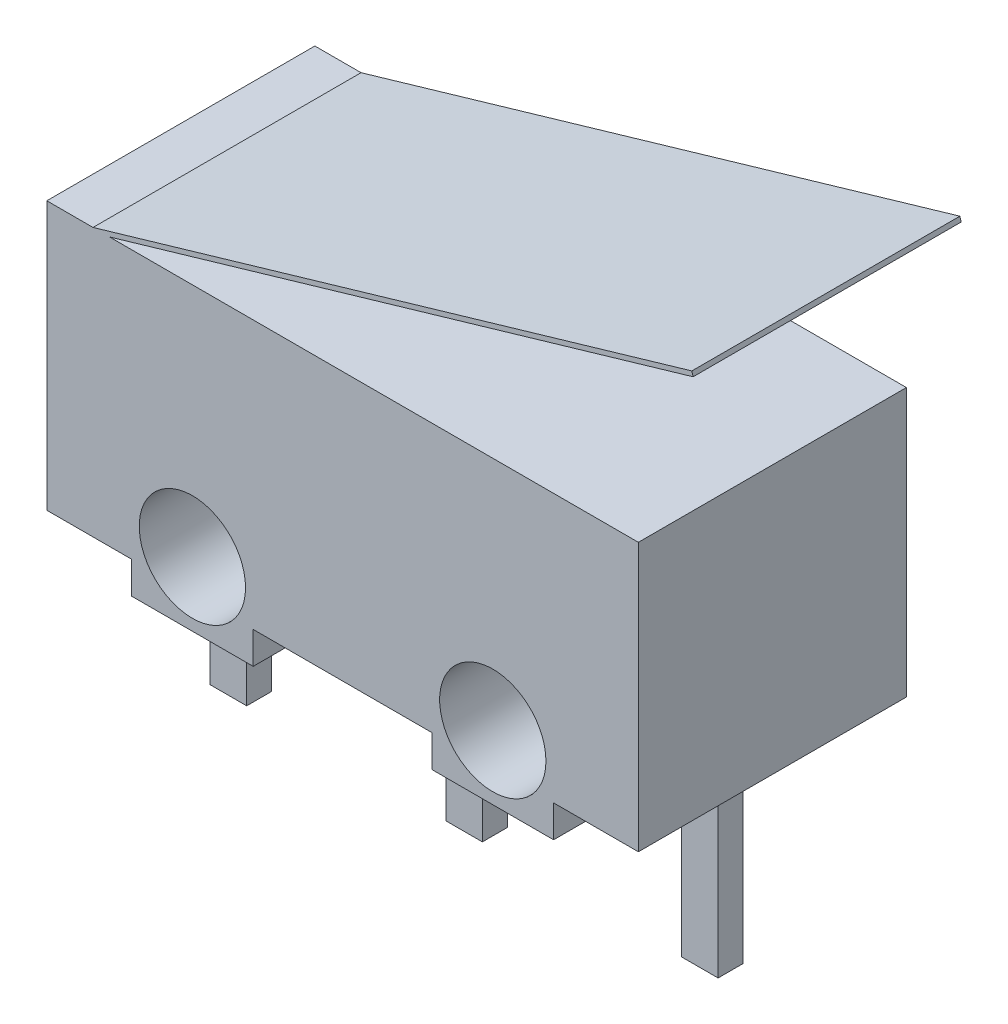
ISO-10303-21;
HEADER;
FILE_DESCRIPTION(('STEP AP214'),'2;1');
FILE_NAME('part.step','',(''),(''),'','','');
FILE_SCHEMA(('AUTOMOTIVE_DESIGN { 1 0 10303 214 1 1 1 1 }'));
ENDSEC;
DATA;
#1=APPLICATION_CONTEXT('core data for automotive mechanical design processes');
#2=APPLICATION_PROTOCOL_DEFINITION('international standard','automotive_design',2000,#1);
#3=PRODUCT_CONTEXT('',#1,'mechanical');
#4=PRODUCT('Part','Part','',(#3));
#5=PRODUCT_RELATED_PRODUCT_CATEGORY('part','',(#4));
#6=PRODUCT_DEFINITION_FORMATION('','',#4);
#7=PRODUCT_DEFINITION_CONTEXT('part definition',#1,'design');
#8=PRODUCT_DEFINITION('design','',#6,#7);
#9=PRODUCT_DEFINITION_SHAPE('','',#8);
#10=(LENGTH_UNIT() NAMED_UNIT(*) SI_UNIT(.MILLI.,.METRE.));
#11=(NAMED_UNIT(*) PLANE_ANGLE_UNIT() SI_UNIT($,.RADIAN.));
#12=(NAMED_UNIT(*) SI_UNIT($,.STERADIAN.) SOLID_ANGLE_UNIT());
#13=UNCERTAINTY_MEASURE_WITH_UNIT(LENGTH_MEASURE(1.E-05),#10,'distance_accuracy_value','');
#14=(GEOMETRIC_REPRESENTATION_CONTEXT(3) GLOBAL_UNCERTAINTY_ASSIGNED_CONTEXT((#13)) GLOBAL_UNIT_ASSIGNED_CONTEXT((#10,
#11,#12)) REPRESENTATION_CONTEXT('',''));
#15=CARTESIAN_POINT('',(0.,0.,0.));
#16=DIRECTION('',(0.,0.,1.));
#17=DIRECTION('',(1.,0.,0.));
#18=AXIS2_PLACEMENT_3D('',#15,#16,#17);
#19=CARTESIAN_POINT('',(6.4,2.9,-2.9));
#20=DIRECTION('',(0.,1.,0.));
#21=DIRECTION('',(-1.,0.,0.));
#22=AXIS2_PLACEMENT_3D('',#19,#20,#21);
#23=PLANE('',#22);
#24=DIRECTION('',(0.,0.,-1.));
#25=VECTOR('',#24,1.);
#26=CARTESIAN_POINT('',(-5.04379947229552,2.9,-2.9));
#27=LINE('',#26,#25);
#28=CARTESIAN_POINT('',(-5.0437994722955,2.9,2.9));
#29=VERTEX_POINT('',#28);
#30=CARTESIAN_POINT('',(-5.0437994722955,2.9,-2.9));
#31=VERTEX_POINT('',#30);
#32=EDGE_CURVE('E413',#29,#31,#27,.T.);
#33=ORIENTED_EDGE('',*,*,#32,.F.);
#34=DIRECTION('',(-1.,0.,0.));
#35=VECTOR('',#34,1.);
#36=CARTESIAN_POINT('',(6.4,2.9,2.9));
#37=LINE('',#36,#35);
#38=CARTESIAN_POINT('',(6.4,2.9,2.9));
#39=VERTEX_POINT('',#38);
#40=EDGE_CURVE('E463',#39,#29,#37,.T.);
#41=ORIENTED_EDGE('',*,*,#40,.F.);
#42=DIRECTION('',(0.,0.,1.));
#43=VECTOR('',#42,1.);
#44=CARTESIAN_POINT('',(6.4,2.9,-2.9));
#45=LINE('',#44,#43);
#46=CARTESIAN_POINT('',(6.4,2.9,-2.9));
#47=VERTEX_POINT('',#46);
#48=EDGE_CURVE('E49',#47,#39,#45,.T.);
#49=ORIENTED_EDGE('',*,*,#48,.F.);
#50=DIRECTION('',(-1.,0.,0.));
#51=VECTOR('',#50,1.);
#52=CARTESIAN_POINT('',(6.4,2.9,-2.9));
#53=LINE('',#52,#51);
#54=EDGE_CURVE('E504',#47,#31,#53,.T.);
#55=ORIENTED_EDGE('',*,*,#54,.T.);
#56=EDGE_LOOP('',(#33,#41,#49,#55));
#57=FACE_BOUND('',#56,.T.);
#58=DIRECTION('',(-1.,0.,0.));
#59=VECTOR('',#58,1.);
#60=CARTESIAN_POINT('',(-2.6,2.9,-1.425));
#61=LINE('',#60,#59);
#62=CARTESIAN_POINT('',(-1.71,2.9,-1.425));
#63=VERTEX_POINT('',#62);
#64=CARTESIAN_POINT('',(-2.6,2.9,-1.425));
#65=VERTEX_POINT('',#64);
#66=EDGE_CURVE('E897',#63,#65,#61,.T.);
#67=ORIENTED_EDGE('',*,*,#66,.F.);
#68=DIRECTION('',(0.,0.,-1.));
#69=VECTOR('',#68,1.);
#70=CARTESIAN_POINT('',(-1.71,2.9,-1.425));
#71=LINE('',#70,#69);
#72=CARTESIAN_POINT('',(-1.71,2.9,1.425));
#73=VERTEX_POINT('',#72);
#74=EDGE_CURVE('E276',#73,#63,#71,.T.);
#75=ORIENTED_EDGE('',*,*,#74,.F.);
#76=DIRECTION('',(1.,0.,0.));
#77=VECTOR('',#76,1.);
#78=CARTESIAN_POINT('',(-2.6,2.9,1.425));
#79=LINE('',#78,#77);
#80=CARTESIAN_POINT('',(-2.6,2.9,1.425));
#81=VERTEX_POINT('',#80);
#82=EDGE_CURVE('E272',#81,#73,#79,.T.);
#83=ORIENTED_EDGE('',*,*,#82,.F.);
#84=DIRECTION('',(0.,0.,1.));
#85=VECTOR('',#84,1.);
#86=CARTESIAN_POINT('',(-2.6,2.9,-1.425));
#87=LINE('',#86,#85);
#88=EDGE_CURVE('E893',#65,#81,#87,.T.);
#89=ORIENTED_EDGE('',*,*,#88,.F.);
#90=EDGE_LOOP('',(#67,#75,#83,#89));
#91=FACE_BOUND('',#90,.T.);
#92=ADVANCED_FACE('F39',(#57,#91),#23,.T.);
#93=CARTESIAN_POINT('',(-5.4,2.9,2.9));
#94=VERTEX_POINT('',#93);
#95=CARTESIAN_POINT('',(-6.4,2.9,2.9));
#96=VERTEX_POINT('',#95);
#97=EDGE_CURVE('E550',#94,#96,#37,.T.);
#98=ORIENTED_EDGE('',*,*,#97,.F.);
#99=DIRECTION('',(0.,0.,1.));
#100=VECTOR('',#99,1.);
#101=CARTESIAN_POINT('',(-5.4,2.9,-16.4541518362062));
#102=LINE('',#101,#100);
#103=CARTESIAN_POINT('',(-5.4,2.9,-2.9));
#104=VERTEX_POINT('',#103);
#105=EDGE_CURVE('E425',#104,#94,#102,.T.);
#106=ORIENTED_EDGE('',*,*,#105,.F.);
#107=CARTESIAN_POINT('',(-6.4,2.9,-2.9));
#108=VERTEX_POINT('',#107);
#109=EDGE_CURVE('E503',#104,#108,#53,.T.);
#110=ORIENTED_EDGE('',*,*,#109,.T.);
#111=DIRECTION('',(0.,0.,1.));
#112=VECTOR('',#111,1.);
#113=CARTESIAN_POINT('',(-6.4,2.9,-2.9));
#114=LINE('',#113,#112);
#115=EDGE_CURVE('E11',#108,#96,#114,.T.);
#116=ORIENTED_EDGE('',*,*,#115,.T.);
#117=EDGE_LOOP('',(#98,#106,#110,#116));
#118=FACE_BOUND('',#117,.T.);
#119=ADVANCED_FACE('F599',(#118),#23,.T.);
#120=CARTESIAN_POINT('',(-6.4,-2.9,-2.9));
#121=DIRECTION('',(-1.,0.,0.));
#122=DIRECTION('',(0.,0.,1.));
#123=AXIS2_PLACEMENT_3D('',#120,#121,#122);
#124=PLANE('',#123);
#125=DIRECTION('',(0.,-1.,0.));
#126=VECTOR('',#125,1.);
#127=CARTESIAN_POINT('',(-6.4,-2.9,2.9));
#128=LINE('',#127,#126);
#129=CARTESIAN_POINT('',(-6.4,-2.9,2.9));
#130=VERTEX_POINT('',#129);
#131=EDGE_CURVE('E454',#96,#130,#128,.T.);
#132=ORIENTED_EDGE('',*,*,#131,.F.);
#133=ORIENTED_EDGE('',*,*,#115,.F.);
#134=DIRECTION('',(0.,-1.,0.));
#135=VECTOR('',#134,1.);
#136=CARTESIAN_POINT('',(-6.4,-2.9,-2.9));
#137=LINE('',#136,#135);
#138=CARTESIAN_POINT('',(-6.4,-2.9,-2.9));
#139=VERTEX_POINT('',#138);
#140=EDGE_CURVE('E458',#108,#139,#137,.T.);
#141=ORIENTED_EDGE('',*,*,#140,.T.);
#142=DIRECTION('',(0.,0.,1.));
#143=VECTOR('',#142,1.);
#144=CARTESIAN_POINT('',(-6.4,-2.9,-2.9));
#145=LINE('',#144,#143);
#146=EDGE_CURVE('E43',#139,#130,#145,.T.);
#147=ORIENTED_EDGE('',*,*,#146,.T.);
#148=EDGE_LOOP('',(#132,#133,#141,#147));
#149=FACE_BOUND('',#148,.T.);
#150=ADVANCED_FACE('F41',(#149),#124,.T.);
#151=CARTESIAN_POINT('',(6.4,-2.9,-2.9));
#152=DIRECTION('',(1.,0.,0.));
#153=DIRECTION('',(0.,0.,-1.));
#154=AXIS2_PLACEMENT_3D('',#151,#152,#153);
#155=PLANE('',#154);
#156=DIRECTION('',(0.,1.,0.));
#157=VECTOR('',#156,1.);
#158=CARTESIAN_POINT('',(6.4,-2.9,2.9));
#159=LINE('',#158,#157);
#160=CARTESIAN_POINT('',(6.4,-2.9,2.9));
#161=VERTEX_POINT('',#160);
#162=EDGE_CURVE('E546',#161,#39,#159,.T.);
#163=ORIENTED_EDGE('',*,*,#162,.F.);
#164=DIRECTION('',(0.,0.,1.));
#165=VECTOR('',#164,1.);
#166=CARTESIAN_POINT('',(6.4,-2.9,-2.9));
#167=LINE('',#166,#165);
#168=CARTESIAN_POINT('',(6.4,-2.9,-2.9));
#169=VERTEX_POINT('',#168);
#170=EDGE_CURVE('E556',#169,#161,#167,.T.);
#171=ORIENTED_EDGE('',*,*,#170,.F.);
#172=DIRECTION('',(0.,1.,0.));
#173=VECTOR('',#172,1.);
#174=CARTESIAN_POINT('',(6.4,-2.9,-2.9));
#175=LINE('',#174,#173);
#176=EDGE_CURVE('E499',#169,#47,#175,.T.);
#177=ORIENTED_EDGE('',*,*,#176,.T.);
#178=ORIENTED_EDGE('',*,*,#48,.T.);
#179=EDGE_LOOP('',(#163,#171,#177,#178));
#180=FACE_BOUND('',#179,.T.);
#181=ADVANCED_FACE('F638',(#180),#155,.T.);
#182=CARTESIAN_POINT('',(4.56583824460717,-2.9,-2.9));
#183=DIRECTION('',(0.,-1.,0.));
#184=DIRECTION('',(1.,0.,0.));
#185=AXIS2_PLACEMENT_3D('',#182,#183,#184);
#186=PLANE('',#185);
#187=DIRECTION('',(1.,0.,0.));
#188=VECTOR('',#187,1.);
#189=CARTESIAN_POINT('',(5.49500000000001,-2.9,0.27));
#190=LINE('',#189,#188);
#191=CARTESIAN_POINT('',(4.705,-2.9,0.27));
#192=VERTEX_POINT('',#191);
#193=CARTESIAN_POINT('',(5.495,-2.9,0.27));
#194=VERTEX_POINT('',#193);
#195=EDGE_CURVE('E319',#192,#194,#190,.T.);
#196=ORIENTED_EDGE('',*,*,#195,.T.);
#197=DIRECTION('',(0.,0.,-1.));
#198=VECTOR('',#197,1.);
#199=CARTESIAN_POINT('',(5.495,-2.9,-0.27));
#200=LINE('',#199,#198);
#201=CARTESIAN_POINT('',(5.495,-2.9,-0.27));
#202=VERTEX_POINT('',#201);
#203=EDGE_CURVE('E316',#194,#202,#200,.T.);
#204=ORIENTED_EDGE('',*,*,#203,.T.);
#205=DIRECTION('',(-1.,0.,0.));
#206=VECTOR('',#205,1.);
#207=CARTESIAN_POINT('',(5.49500000000001,-2.9,-0.27));
#208=LINE('',#207,#206);
#209=CARTESIAN_POINT('',(4.705,-2.9,-0.27));
#210=VERTEX_POINT('',#209);
#211=EDGE_CURVE('E279',#202,#210,#208,.T.);
#212=ORIENTED_EDGE('',*,*,#211,.T.);
#213=DIRECTION('',(0.,0.,1.));
#214=VECTOR('',#213,1.);
#215=CARTESIAN_POINT('',(4.705,-2.9,-0.27));
#216=LINE('',#215,#214);
#217=EDGE_CURVE('E65',#210,#192,#216,.T.);
#218=ORIENTED_EDGE('',*,*,#217,.T.);
#219=EDGE_LOOP('',(#196,#204,#212,#218));
#220=FACE_BOUND('',#219,.T.);
#221=DIRECTION('',(1.,0.,0.));
#222=VECTOR('',#221,1.);
#223=CARTESIAN_POINT('',(4.56583824460717,-2.9,2.9));
#224=LINE('',#223,#222);
#225=CARTESIAN_POINT('',(4.56583824460717,-2.9,2.9));
#226=VERTEX_POINT('',#225);
#227=EDGE_CURVE('E542',#226,#161,#224,.T.);
#228=ORIENTED_EDGE('',*,*,#227,.F.);
#229=DIRECTION('',(0.,0.,1.));
#230=VECTOR('',#229,1.);
#231=CARTESIAN_POINT('',(4.56583824460717,-2.9,-2.9));
#232=LINE('',#231,#230);
#233=CARTESIAN_POINT('',(4.56583824460717,-2.9,-2.9));
#234=VERTEX_POINT('',#233);
#235=EDGE_CURVE('E559',#234,#226,#232,.T.);
#236=ORIENTED_EDGE('',*,*,#235,.F.);
#237=DIRECTION('',(1.,0.,0.));
#238=VECTOR('',#237,1.);
#239=CARTESIAN_POINT('',(4.56583824460717,-2.9,-2.9));
#240=LINE('',#239,#238);
#241=EDGE_CURVE('E495',#234,#169,#240,.T.);
#242=ORIENTED_EDGE('',*,*,#241,.T.);
#243=ORIENTED_EDGE('',*,*,#170,.T.);
#244=EDGE_LOOP('',(#228,#236,#242,#243));
#245=FACE_BOUND('',#244,.T.);
#246=ADVANCED_FACE('F634',(#220,#245),#186,.T.);
#247=CARTESIAN_POINT('',(4.56583824460717,-3.5923412014627,-2.9));
#248=DIRECTION('',(1.,0.,0.));
#249=DIRECTION('',(0.,0.,-1.));
#250=AXIS2_PLACEMENT_3D('',#247,#248,#249);
#251=PLANE('',#250);
#252=DIRECTION('',(0.,1.,0.));
#253=VECTOR('',#252,1.);
#254=CARTESIAN_POINT('',(4.56583824460717,-3.5923412014627,2.9));
#255=LINE('',#254,#253);
#256=CARTESIAN_POINT('',(4.56583824460717,-3.5923412014627,2.9));
#257=VERTEX_POINT('',#256);
#258=EDGE_CURVE('E538',#257,#226,#255,.T.);
#259=ORIENTED_EDGE('',*,*,#258,.F.);
#260=DIRECTION('',(0.,0.,1.));
#261=VECTOR('',#260,1.);
#262=CARTESIAN_POINT('',(4.56583824460717,-3.5923412014627,-2.9));
#263=LINE('',#262,#261);
#264=CARTESIAN_POINT('',(4.56583824460717,-3.5923412014627,-2.9));
#265=VERTEX_POINT('',#264);
#266=EDGE_CURVE('E562',#265,#257,#263,.T.);
#267=ORIENTED_EDGE('',*,*,#266,.F.);
#268=DIRECTION('',(0.,1.,0.));
#269=VECTOR('',#268,1.);
#270=CARTESIAN_POINT('',(4.56583824460717,-3.5923412014627,-2.9));
#271=LINE('',#270,#269);
#272=EDGE_CURVE('E491',#265,#234,#271,.T.);
#273=ORIENTED_EDGE('',*,*,#272,.T.);
#274=ORIENTED_EDGE('',*,*,#235,.T.);
#275=EDGE_LOOP('',(#259,#267,#273,#274));
#276=FACE_BOUND('',#275,.T.);
#277=ADVANCED_FACE('F629',(#276),#251,.T.);
#278=CARTESIAN_POINT('',(1.93416175539283,-3.5923412014627,-2.9));
#279=DIRECTION('',(0.,-1.,0.));
#280=DIRECTION('',(0.,0.,-1.));
#281=AXIS2_PLACEMENT_3D('',#278,#279,#280);
#282=PLANE('',#281);
#283=DIRECTION('',(1.,0.,0.));
#284=VECTOR('',#283,1.);
#285=CARTESIAN_POINT('',(1.93416175539283,-3.5923412014627,2.9));
#286=LINE('',#285,#284);
#287=CARTESIAN_POINT('',(1.93416175539283,-3.5923412014627,2.9));
#288=VERTEX_POINT('',#287);
#289=EDGE_CURVE('E534',#288,#257,#286,.T.);
#290=ORIENTED_EDGE('',*,*,#289,.F.);
#291=DIRECTION('',(0.,0.,1.));
#292=VECTOR('',#291,1.);
#293=CARTESIAN_POINT('',(1.93416175539283,-3.5923412014627,-2.9));
#294=LINE('',#293,#292);
#295=CARTESIAN_POINT('',(1.93416175539283,-3.5923412014627,-2.9));
#296=VERTEX_POINT('',#295);
#297=EDGE_CURVE('E565',#296,#288,#294,.T.);
#298=ORIENTED_EDGE('',*,*,#297,.F.);
#299=DIRECTION('',(1.,0.,0.));
#300=VECTOR('',#299,1.);
#301=CARTESIAN_POINT('',(1.93416175539283,-3.5923412014627,-2.9));
#302=LINE('',#301,#300);
#303=EDGE_CURVE('E487',#296,#265,#302,.T.);
#304=ORIENTED_EDGE('',*,*,#303,.T.);
#305=ORIENTED_EDGE('',*,*,#266,.T.);
#306=EDGE_LOOP('',(#290,#298,#304,#305));
#307=FACE_BOUND('',#306,.T.);
#308=ADVANCED_FACE('F625',(#307),#282,.T.);
#309=CARTESIAN_POINT('',(1.93416175539283,-2.9,-2.9));
#310=DIRECTION('',(-1.,0.,0.));
#311=DIRECTION('',(0.,0.,1.));
#312=AXIS2_PLACEMENT_3D('',#309,#310,#311);
#313=PLANE('',#312);
#314=DIRECTION('',(0.,-1.,0.));
#315=VECTOR('',#314,1.);
#316=CARTESIAN_POINT('',(1.93416175539283,-2.9,2.9));
#317=LINE('',#316,#315);
#318=CARTESIAN_POINT('',(1.93416175539283,-2.9,2.9));
#319=VERTEX_POINT('',#318);
#320=EDGE_CURVE('E530',#319,#288,#317,.T.);
#321=ORIENTED_EDGE('',*,*,#320,.F.);
#322=DIRECTION('',(0.,0.,1.));
#323=VECTOR('',#322,1.);
#324=CARTESIAN_POINT('',(1.93416175539283,-2.9,-2.9));
#325=LINE('',#324,#323);
#326=CARTESIAN_POINT('',(1.93416175539283,-2.9,-2.9));
#327=VERTEX_POINT('',#326);
#328=EDGE_CURVE('E568',#327,#319,#325,.T.);
#329=ORIENTED_EDGE('',*,*,#328,.F.);
#330=DIRECTION('',(0.,-1.,0.));
#331=VECTOR('',#330,1.);
#332=CARTESIAN_POINT('',(1.93416175539283,-2.9,-2.9));
#333=LINE('',#332,#331);
#334=EDGE_CURVE('E483',#327,#296,#333,.T.);
#335=ORIENTED_EDGE('',*,*,#334,.T.);
#336=ORIENTED_EDGE('',*,*,#297,.T.);
#337=EDGE_LOOP('',(#321,#329,#335,#336));
#338=FACE_BOUND('',#337,.T.);
#339=ADVANCED_FACE('F621',(#338),#313,.T.);
#340=CARTESIAN_POINT('',(-1.93416175539283,-2.9,-2.9));
#341=DIRECTION('',(0.,-1.,0.));
#342=DIRECTION('',(0.,0.,-1.));
#343=AXIS2_PLACEMENT_3D('',#340,#341,#342);
#344=PLANE('',#343);
#345=DIRECTION('',(-1.,0.,0.));
#346=VECTOR('',#345,1.);
#347=CARTESIAN_POINT('',(0.395,-2.9,-0.27));
#348=LINE('',#347,#346);
#349=CARTESIAN_POINT('',(0.394999999999999,-2.9,-0.27));
#350=VERTEX_POINT('',#349);
#351=CARTESIAN_POINT('',(-0.395,-2.9,-0.27));
#352=VERTEX_POINT('',#351);
#353=EDGE_CURVE('E396',#350,#352,#348,.T.);
#354=ORIENTED_EDGE('',*,*,#353,.T.);
#355=DIRECTION('',(0.,0.,1.));
#356=VECTOR('',#355,1.);
#357=CARTESIAN_POINT('',(-0.395,-2.9,-0.27));
#358=LINE('',#357,#356);
#359=CARTESIAN_POINT('',(-0.395,-2.9,0.27));
#360=VERTEX_POINT('',#359);
#361=EDGE_CURVE('E393',#352,#360,#358,.T.);
#362=ORIENTED_EDGE('',*,*,#361,.T.);
#363=DIRECTION('',(1.,0.,0.));
#364=VECTOR('',#363,1.);
#365=CARTESIAN_POINT('',(0.395,-2.9,0.27));
#366=LINE('',#365,#364);
#367=CARTESIAN_POINT('',(0.395,-2.9,0.27));
#368=VERTEX_POINT('',#367);
#369=EDGE_CURVE('E355',#360,#368,#366,.T.);
#370=ORIENTED_EDGE('',*,*,#369,.T.);
#371=DIRECTION('',(0.,0.,-1.));
#372=VECTOR('',#371,1.);
#373=CARTESIAN_POINT('',(0.395,-2.9,-0.27));
#374=LINE('',#373,#372);
#375=EDGE_CURVE('E399',#368,#350,#374,.T.);
#376=ORIENTED_EDGE('',*,*,#375,.T.);
#377=EDGE_LOOP('',(#354,#362,#370,#376));
#378=FACE_BOUND('',#377,.T.);
#379=DIRECTION('',(1.,0.,0.));
#380=VECTOR('',#379,1.);
#381=CARTESIAN_POINT('',(-1.93416175539283,-2.9,2.9));
#382=LINE('',#381,#380);
#383=CARTESIAN_POINT('',(-1.93416175539283,-2.9,2.9));
#384=VERTEX_POINT('',#383);
#385=EDGE_CURVE('E526',#384,#319,#382,.T.);
#386=ORIENTED_EDGE('',*,*,#385,.F.);
#387=DIRECTION('',(0.,0.,1.));
#388=VECTOR('',#387,1.);
#389=CARTESIAN_POINT('',(-1.93416175539283,-2.9,-2.9));
#390=LINE('',#389,#388);
#391=CARTESIAN_POINT('',(-1.93416175539283,-2.9,-2.9));
#392=VERTEX_POINT('',#391);
#393=EDGE_CURVE('E571',#392,#384,#390,.T.);
#394=ORIENTED_EDGE('',*,*,#393,.F.);
#395=DIRECTION('',(1.,0.,0.));
#396=VECTOR('',#395,1.);
#397=CARTESIAN_POINT('',(-1.93416175539283,-2.9,-2.9));
#398=LINE('',#397,#396);
#399=EDGE_CURVE('E479',#392,#327,#398,.T.);
#400=ORIENTED_EDGE('',*,*,#399,.T.);
#401=ORIENTED_EDGE('',*,*,#328,.T.);
#402=EDGE_LOOP('',(#386,#394,#400,#401));
#403=FACE_BOUND('',#402,.T.);
#404=ADVANCED_FACE('F617',(#378,#403),#344,.T.);
#405=CARTESIAN_POINT('',(-1.93416175539283,-3.5923412014627,-2.9));
#406=DIRECTION('',(1.,0.,0.));
#407=DIRECTION('',(0.,0.,-1.));
#408=AXIS2_PLACEMENT_3D('',#405,#406,#407);
#409=PLANE('',#408);
#410=DIRECTION('',(0.,1.,0.));
#411=VECTOR('',#410,1.);
#412=CARTESIAN_POINT('',(-1.93416175539283,-3.5923412014627,2.9));
#413=LINE('',#412,#411);
#414=CARTESIAN_POINT('',(-1.93416175539283,-3.5923412014627,2.9));
#415=VERTEX_POINT('',#414);
#416=EDGE_CURVE('E522',#415,#384,#413,.T.);
#417=ORIENTED_EDGE('',*,*,#416,.F.);
#418=DIRECTION('',(0.,0.,1.));
#419=VECTOR('',#418,1.);
#420=CARTESIAN_POINT('',(-1.93416175539283,-3.5923412014627,-2.9));
#421=LINE('',#420,#419);
#422=CARTESIAN_POINT('',(-1.93416175539283,-3.5923412014627,-2.9));
#423=VERTEX_POINT('',#422);
#424=EDGE_CURVE('E574',#423,#415,#421,.T.);
#425=ORIENTED_EDGE('',*,*,#424,.F.);
#426=DIRECTION('',(0.,1.,0.));
#427=VECTOR('',#426,1.);
#428=CARTESIAN_POINT('',(-1.93416175539283,-3.5923412014627,-2.9));
#429=LINE('',#428,#427);
#430=EDGE_CURVE('E475',#423,#392,#429,.T.);
#431=ORIENTED_EDGE('',*,*,#430,.T.);
#432=ORIENTED_EDGE('',*,*,#393,.T.);
#433=EDGE_LOOP('',(#417,#425,#431,#432));
#434=FACE_BOUND('',#433,.T.);
#435=ADVANCED_FACE('F613',(#434),#409,.T.);
#436=CARTESIAN_POINT('',(-4.56583824460717,-3.5923412014627,-2.9));
#437=DIRECTION('',(0.,-1.,0.));
#438=DIRECTION('',(0.,0.,-1.));
#439=AXIS2_PLACEMENT_3D('',#436,#437,#438);
#440=PLANE('',#439);
#441=DIRECTION('',(1.,0.,0.));
#442=VECTOR('',#441,1.);
#443=CARTESIAN_POINT('',(-4.56583824460717,-3.5923412014627,2.9));
#444=LINE('',#443,#442);
#445=CARTESIAN_POINT('',(-4.56583824460717,-3.5923412014627,2.9));
#446=VERTEX_POINT('',#445);
#447=EDGE_CURVE('E518',#446,#415,#444,.T.);
#448=ORIENTED_EDGE('',*,*,#447,.F.);
#449=DIRECTION('',(0.,0.,1.));
#450=VECTOR('',#449,1.);
#451=CARTESIAN_POINT('',(-4.56583824460717,-3.5923412014627,-2.9));
#452=LINE('',#451,#450);
#453=CARTESIAN_POINT('',(-4.56583824460717,-3.5923412014627,-2.9));
#454=VERTEX_POINT('',#453);
#455=EDGE_CURVE('E577',#454,#446,#452,.T.);
#456=ORIENTED_EDGE('',*,*,#455,.F.);
#457=DIRECTION('',(1.,0.,0.));
#458=VECTOR('',#457,1.);
#459=CARTESIAN_POINT('',(-4.56583824460717,-3.5923412014627,-2.9));
#460=LINE('',#459,#458);
#461=EDGE_CURVE('E471',#454,#423,#460,.T.);
#462=ORIENTED_EDGE('',*,*,#461,.T.);
#463=ORIENTED_EDGE('',*,*,#424,.T.);
#464=EDGE_LOOP('',(#448,#456,#462,#463));
#465=FACE_BOUND('',#464,.T.);
#466=ADVANCED_FACE('F611',(#465),#440,.T.);
#467=CARTESIAN_POINT('',(-4.56583824460717,-2.9,-2.9));
#468=DIRECTION('',(-1.,0.,0.));
#469=DIRECTION('',(0.,0.,1.));
#470=AXIS2_PLACEMENT_3D('',#467,#468,#469);
#471=PLANE('',#470);
#472=DIRECTION('',(0.,-1.,0.));
#473=VECTOR('',#472,1.);
#474=CARTESIAN_POINT('',(-4.56583824460717,-2.9,2.9));
#475=LINE('',#474,#473);
#476=CARTESIAN_POINT('',(-4.56583824460717,-2.9,2.9));
#477=VERTEX_POINT('',#476);
#478=EDGE_CURVE('E514',#477,#446,#475,.T.);
#479=ORIENTED_EDGE('',*,*,#478,.F.);
#480=DIRECTION('',(0.,0.,1.));
#481=VECTOR('',#480,1.);
#482=CARTESIAN_POINT('',(-4.56583824460717,-2.9,-2.9));
#483=LINE('',#482,#481);
#484=CARTESIAN_POINT('',(-4.56583824460717,-2.9,-2.9));
#485=VERTEX_POINT('',#484);
#486=EDGE_CURVE('E579',#485,#477,#483,.T.);
#487=ORIENTED_EDGE('',*,*,#486,.F.);
#488=DIRECTION('',(0.,-1.,0.));
#489=VECTOR('',#488,1.);
#490=CARTESIAN_POINT('',(-4.56583824460717,-2.9,-2.9));
#491=LINE('',#490,#489);
#492=EDGE_CURVE('E467',#485,#454,#491,.T.);
#493=ORIENTED_EDGE('',*,*,#492,.T.);
#494=ORIENTED_EDGE('',*,*,#455,.T.);
#495=EDGE_LOOP('',(#479,#487,#493,#494));
#496=FACE_BOUND('',#495,.T.);
#497=ADVANCED_FACE('F607',(#496),#471,.T.);
#498=CARTESIAN_POINT('',(-6.4,-2.9,-2.9));
#499=DIRECTION('',(0.,-1.,0.));
#500=DIRECTION('',(1.,0.,0.));
#501=AXIS2_PLACEMENT_3D('',#498,#499,#500);
#502=PLANE('',#501);
#503=DIRECTION('',(1.,0.,0.));
#504=VECTOR('',#503,1.);
#505=CARTESIAN_POINT('',(-5.495,-2.9,0.27));
#506=LINE('',#505,#504);
#507=CARTESIAN_POINT('',(-5.495,-2.9,0.27));
#508=VERTEX_POINT('',#507);
#509=CARTESIAN_POINT('',(-4.705,-2.9,0.27));
#510=VERTEX_POINT('',#509);
#511=EDGE_CURVE('E359',#508,#510,#506,.T.);
#512=ORIENTED_EDGE('',*,*,#511,.T.);
#513=DIRECTION('',(0.,0.,-1.));
#514=VECTOR('',#513,1.);
#515=CARTESIAN_POINT('',(-4.705,-2.9,-0.27));
#516=LINE('',#515,#514);
#517=CARTESIAN_POINT('',(-4.705,-2.9,-0.27));
#518=VERTEX_POINT('',#517);
#519=EDGE_CURVE('E349',#510,#518,#516,.T.);
#520=ORIENTED_EDGE('',*,*,#519,.T.);
#521=DIRECTION('',(-1.,0.,0.));
#522=VECTOR('',#521,1.);
#523=CARTESIAN_POINT('',(-5.495,-2.9,-0.27));
#524=LINE('',#523,#522);
#525=CARTESIAN_POINT('',(-5.495,-2.9,-0.27));
#526=VERTEX_POINT('',#525);
#527=EDGE_CURVE('E352',#518,#526,#524,.T.);
#528=ORIENTED_EDGE('',*,*,#527,.T.);
#529=DIRECTION('',(0.,0.,1.));
#530=VECTOR('',#529,1.);
#531=CARTESIAN_POINT('',(-5.495,-2.9,-0.27));
#532=LINE('',#531,#530);
#533=EDGE_CURVE('E356',#526,#508,#532,.T.);
#534=ORIENTED_EDGE('',*,*,#533,.T.);
#535=EDGE_LOOP('',(#512,#520,#528,#534));
#536=FACE_BOUND('',#535,.T.);
#537=DIRECTION('',(1.,0.,0.));
#538=VECTOR('',#537,1.);
#539=CARTESIAN_POINT('',(-6.4,-2.9,2.9));
#540=LINE('',#539,#538);
#541=EDGE_CURVE('E510',#130,#477,#540,.T.);
#542=ORIENTED_EDGE('',*,*,#541,.F.);
#543=ORIENTED_EDGE('',*,*,#146,.F.);
#544=DIRECTION('',(1.,0.,0.));
#545=VECTOR('',#544,1.);
#546=CARTESIAN_POINT('',(-6.4,-2.9,-2.9));
#547=LINE('',#546,#545);
#548=EDGE_CURVE('E462',#139,#485,#547,.T.);
#549=ORIENTED_EDGE('',*,*,#548,.T.);
#550=ORIENTED_EDGE('',*,*,#486,.T.);
#551=EDGE_LOOP('',(#542,#543,#549,#550));
#552=FACE_BOUND('',#551,.T.);
#553=ADVANCED_FACE('F590',(#536,#552),#502,.T.);
#554=CARTESIAN_POINT('',(0.,0.,-2.9));
#555=DIRECTION('',(0.,0.,1.));
#556=DIRECTION('',(1.,0.,0.));
#557=AXIS2_PLACEMENT_3D('',#554,#555,#556);
#558=PLANE('',#557);
#559=ORIENTED_EDGE('',*,*,#109,.F.);
#560=DIRECTION('',(-0.959783640456713,-0.280740740740741,0.));
#561=VECTOR('',#560,1.);
#562=CARTESIAN_POINT('',(-5.4,2.9,-2.9));
#563=LINE('',#562,#561);
#564=CARTESIAN_POINT('',(7.55707914616562,6.69,-2.9));
#565=VERTEX_POINT('',#564);
#566=EDGE_CURVE('E404',#565,#104,#563,.T.);
#567=ORIENTED_EDGE('',*,*,#566,.F.);
#568=DIRECTION('',(-0.280740740740791,0.959783640456698,0.));
#569=VECTOR('',#568,1.);
#570=CARTESIAN_POINT('',(7.55707914616562,6.69,-2.9));
#571=LINE('',#570,#569);
#572=CARTESIAN_POINT('',(7.5851532202397,6.59402163595433,-2.9));
#573=VERTEX_POINT('',#572);
#574=EDGE_CURVE('E409',#573,#565,#571,.T.);
#575=ORIENTED_EDGE('',*,*,#574,.F.);
#576=DIRECTION('',(-0.959783640456713,-0.280740740740741,0.));
#577=VECTOR('',#576,1.);
#578=CARTESIAN_POINT('',(-5.37192592592593,2.80402163595433,-2.9));
#579=LINE('',#578,#577);
#580=EDGE_CURVE('E408',#573,#31,#579,.T.);
#581=ORIENTED_EDGE('',*,*,#580,.T.);
#582=ORIENTED_EDGE('',*,*,#54,.F.);
#583=ORIENTED_EDGE('',*,*,#176,.F.);
#584=ORIENTED_EDGE('',*,*,#241,.F.);
#585=ORIENTED_EDGE('',*,*,#272,.F.);
#586=ORIENTED_EDGE('',*,*,#303,.F.);
#587=ORIENTED_EDGE('',*,*,#334,.F.);
#588=ORIENTED_EDGE('',*,*,#399,.F.);
#589=ORIENTED_EDGE('',*,*,#430,.F.);
#590=ORIENTED_EDGE('',*,*,#461,.F.);
#591=ORIENTED_EDGE('',*,*,#492,.F.);
#592=ORIENTED_EDGE('',*,*,#548,.F.);
#593=ORIENTED_EDGE('',*,*,#140,.F.);
#594=EDGE_LOOP('',(#559,#567,#575,#581,#582,#583,#584,#585,#586,#587,#588,#589,#590,#591,#592,#593));
#595=FACE_BOUND('',#594,.T.);
#596=CARTESIAN_POINT('',(-3.25,-2.2,-2.9));
#597=DIRECTION('',(0.,0.,1.));
#598=DIRECTION('',(1.,0.,0.));
#599=AXIS2_PLACEMENT_3D('',#596,#597,#598);
#600=CIRCLE('',#599,1.15);
#601=CARTESIAN_POINT('',(-2.1,-2.2,-2.9));
#602=VERTEX_POINT('',#601);
#603=EDGE_CURVE('E450',#602,#602,#600,.T.);
#604=ORIENTED_EDGE('',*,*,#603,.T.);
#605=EDGE_LOOP('',(#604));
#606=FACE_BOUND('',#605,.T.);
#607=CARTESIAN_POINT('',(3.25,-2.2,-2.9));
#608=DIRECTION('',(0.,0.,1.));
#609=DIRECTION('',(1.,0.,0.));
#610=AXIS2_PLACEMENT_3D('',#607,#608,#609);
#611=CIRCLE('',#610,1.15);
#612=CARTESIAN_POINT('',(4.4,-2.2,-2.9));
#613=VERTEX_POINT('',#612);
#614=EDGE_CURVE('E442',#613,#613,#611,.T.);
#615=ORIENTED_EDGE('',*,*,#614,.T.);
#616=EDGE_LOOP('',(#615));
#617=FACE_BOUND('',#616,.T.);
#618=ADVANCED_FACE('F601',(#595,#606,#617),#558,.F.);
#619=CARTESIAN_POINT('',(0.,0.,2.9));
#620=DIRECTION('',(0.,0.,1.));
#621=DIRECTION('',(1.,0.,0.));
#622=AXIS2_PLACEMENT_3D('',#619,#620,#621);
#623=PLANE('',#622);
#624=ORIENTED_EDGE('',*,*,#40,.T.);
#625=DIRECTION('',(0.959783640456713,0.280740740740741,0.));
#626=VECTOR('',#625,1.);
#627=CARTESIAN_POINT('',(-5.37192592592593,2.80402163595433,2.9));
#628=LINE('',#627,#626);
#629=CARTESIAN_POINT('',(7.5851532202397,6.59402163595433,2.9));
#630=VERTEX_POINT('',#629);
#631=EDGE_CURVE('E368',#29,#630,#628,.T.);
#632=ORIENTED_EDGE('',*,*,#631,.T.);
#633=DIRECTION('',(0.280740740740791,-0.959783640456698,0.));
#634=VECTOR('',#633,1.);
#635=CARTESIAN_POINT('',(7.55707914616562,6.69,2.9));
#636=LINE('',#635,#634);
#637=CARTESIAN_POINT('',(7.55707914616562,6.69,2.9));
#638=VERTEX_POINT('',#637);
#639=EDGE_CURVE('E416',#638,#630,#636,.T.);
#640=ORIENTED_EDGE('',*,*,#639,.F.);
#641=DIRECTION('',(0.959783640456712,0.280740740740741,0.));
#642=VECTOR('',#641,1.);
#643=CARTESIAN_POINT('',(-5.4,2.9,2.9));
#644=LINE('',#643,#642);
#645=EDGE_CURVE('E420',#94,#638,#644,.T.);
#646=ORIENTED_EDGE('',*,*,#645,.F.);
#647=ORIENTED_EDGE('',*,*,#97,.T.);
#648=ORIENTED_EDGE('',*,*,#131,.T.);
#649=ORIENTED_EDGE('',*,*,#541,.T.);
#650=ORIENTED_EDGE('',*,*,#478,.T.);
#651=ORIENTED_EDGE('',*,*,#447,.T.);
#652=ORIENTED_EDGE('',*,*,#416,.T.);
#653=ORIENTED_EDGE('',*,*,#385,.T.);
#654=ORIENTED_EDGE('',*,*,#320,.T.);
#655=ORIENTED_EDGE('',*,*,#289,.T.);
#656=ORIENTED_EDGE('',*,*,#258,.T.);
#657=ORIENTED_EDGE('',*,*,#227,.T.);
#658=ORIENTED_EDGE('',*,*,#162,.T.);
#659=EDGE_LOOP('',(#624,#632,#640,#646,#647,#648,#649,#650,#651,#652,#653,#654,#655,#656,#657,#658));
#660=FACE_BOUND('',#659,.T.);
#661=CARTESIAN_POINT('',(3.25,-2.2,2.9));
#662=DIRECTION('',(0.,0.,1.));
#663=DIRECTION('',(1.,0.,0.));
#664=AXIS2_PLACEMENT_3D('',#661,#662,#663);
#665=CIRCLE('',#664,1.15);
#666=CARTESIAN_POINT('',(4.4,-2.2,2.9));
#667=VERTEX_POINT('',#666);
#668=EDGE_CURVE('E441',#667,#667,#665,.T.);
#669=ORIENTED_EDGE('',*,*,#668,.F.);
#670=EDGE_LOOP('',(#669));
#671=FACE_BOUND('',#670,.T.);
#672=CARTESIAN_POINT('',(-3.25,-2.2,2.9));
#673=DIRECTION('',(0.,0.,1.));
#674=DIRECTION('',(1.,0.,0.));
#675=AXIS2_PLACEMENT_3D('',#672,#673,#674);
#676=CIRCLE('',#675,1.15);
#677=CARTESIAN_POINT('',(-2.1,-2.2,2.9));
#678=VERTEX_POINT('',#677);
#679=EDGE_CURVE('E446',#678,#678,#676,.T.);
#680=ORIENTED_EDGE('',*,*,#679,.F.);
#681=EDGE_LOOP('',(#680));
#682=FACE_BOUND('',#681,.T.);
#683=ADVANCED_FACE('F592',(#660,#671,#682),#623,.T.);
#684=CARTESIAN_POINT('',(-3.25,-2.2,-2.9));
#685=DIRECTION('',(0.,0.,1.));
#686=DIRECTION('',(1.,0.,0.));
#687=AXIS2_PLACEMENT_3D('',#684,#685,#686);
#688=CYLINDRICAL_SURFACE('',#687,1.15);
#689=ORIENTED_EDGE('',*,*,#603,.F.);
#690=EDGE_LOOP('',(#689));
#691=FACE_BOUND('',#690,.T.);
#692=ORIENTED_EDGE('',*,*,#679,.T.);
#693=EDGE_LOOP('',(#692));
#694=FACE_BOUND('',#693,.T.);
#695=ADVANCED_FACE('F962',(#691,#694),#688,.F.);
#696=CARTESIAN_POINT('',(3.25,-2.2,-2.9));
#697=DIRECTION('',(0.,0.,1.));
#698=DIRECTION('',(1.,0.,0.));
#699=AXIS2_PLACEMENT_3D('',#696,#697,#698);
#700=CYLINDRICAL_SURFACE('',#699,1.15);
#701=ORIENTED_EDGE('',*,*,#614,.F.);
#702=EDGE_LOOP('',(#701));
#703=FACE_BOUND('',#702,.T.);
#704=ORIENTED_EDGE('',*,*,#668,.T.);
#705=EDGE_LOOP('',(#704));
#706=FACE_BOUND('',#705,.T.);
#707=ADVANCED_FACE('F661',(#703,#706),#700,.F.);
#708=CARTESIAN_POINT('',(7.55707914616562,6.69,-16.4541518362062));
#709=DIRECTION('',(-0.959783640456698,-0.280740740740791,0.));
#710=DIRECTION('',(0.280740740740791,-0.959783640456698,0.));
#711=AXIS2_PLACEMENT_3D('',#708,#709,#710);
#712=PLANE('',#711);
#713=DIRECTION('',(0.,0.,1.));
#714=VECTOR('',#713,1.);
#715=CARTESIAN_POINT('',(7.5851532202397,6.59402163595433,-16.4541518362062));
#716=LINE('',#715,#714);
#717=EDGE_CURVE('E424',#573,#630,#716,.T.);
#718=ORIENTED_EDGE('',*,*,#717,.F.);
#719=ORIENTED_EDGE('',*,*,#574,.T.);
#720=DIRECTION('',(0.,0.,1.));
#721=VECTOR('',#720,1.);
#722=CARTESIAN_POINT('',(7.55707914616562,6.69,-16.4541518362062));
#723=LINE('',#722,#721);
#724=EDGE_CURVE('E429',#565,#638,#723,.T.);
#725=ORIENTED_EDGE('',*,*,#724,.T.);
#726=ORIENTED_EDGE('',*,*,#639,.T.);
#727=EDGE_LOOP('',(#718,#719,#725,#726));
#728=FACE_BOUND('',#727,.T.);
#729=ADVANCED_FACE('F648',(#728),#712,.F.);
#730=CARTESIAN_POINT('',(-5.4,2.9,-16.4541518362062));
#731=DIRECTION('',(0.280740740740741,-0.959783640456713,0.));
#732=DIRECTION('',(0.959783640456713,0.280740740740741,0.));
#733=AXIS2_PLACEMENT_3D('',#730,#731,#732);
#734=PLANE('',#733);
#735=ORIENTED_EDGE('',*,*,#724,.F.);
#736=ORIENTED_EDGE('',*,*,#566,.T.);
#737=ORIENTED_EDGE('',*,*,#105,.T.);
#738=ORIENTED_EDGE('',*,*,#645,.T.);
#739=EDGE_LOOP('',(#735,#736,#737,#738));
#740=FACE_BOUND('',#739,.T.);
#741=ADVANCED_FACE('F651',(#740),#734,.F.);
#742=CARTESIAN_POINT('',(-5.37192592592593,2.80402163595433,-16.4541518362062));
#743=DIRECTION('',(0.280740740740741,-0.959783640456713,0.));
#744=DIRECTION('',(0.959783640456713,0.280740740740741,0.));
#745=AXIS2_PLACEMENT_3D('',#742,#743,#744);
#746=PLANE('',#745);
#747=ORIENTED_EDGE('',*,*,#631,.F.);
#748=ORIENTED_EDGE('',*,*,#32,.T.);
#749=ORIENTED_EDGE('',*,*,#580,.F.);
#750=ORIENTED_EDGE('',*,*,#717,.T.);
#751=EDGE_LOOP('',(#747,#748,#749,#750));
#752=FACE_BOUND('',#751,.T.);
#753=ADVANCED_FACE('F644',(#752),#746,.T.);
#754=CARTESIAN_POINT('',(0.395,6.692,-0.27));
#755=DIRECTION('',(0.,0.,-1.));
#756=DIRECTION('',(-1.,0.,0.));
#757=AXIS2_PLACEMENT_3D('',#754,#755,#756);
#758=PLANE('',#757);
#759=ORIENTED_EDGE('',*,*,#353,.F.);
#760=DIRECTION('',(0.,-1.,0.));
#761=VECTOR('',#760,1.);
#762=CARTESIAN_POINT('',(0.395,6.692,-0.27));
#763=LINE('',#762,#761);
#764=CARTESIAN_POINT('',(0.395,-7.0323412014627,-0.27));
#765=VERTEX_POINT('',#764);
#766=EDGE_CURVE('E387',#350,#765,#763,.T.);
#767=ORIENTED_EDGE('',*,*,#766,.T.);
#768=DIRECTION('',(1.,0.,0.));
#769=VECTOR('',#768,1.);
#770=CARTESIAN_POINT('',(0.395,-7.0323412014627,-0.27));
#771=LINE('',#770,#769);
#772=CARTESIAN_POINT('',(-0.395,-7.0323412014627,-0.27));
#773=VERTEX_POINT('',#772);
#774=EDGE_CURVE('E370',#773,#765,#771,.T.);
#775=ORIENTED_EDGE('',*,*,#774,.F.);
#776=DIRECTION('',(0.,-1.,0.));
#777=VECTOR('',#776,1.);
#778=CARTESIAN_POINT('',(-0.395,6.692,-0.27));
#779=LINE('',#778,#777);
#780=EDGE_CURVE('E390',#352,#773,#779,.T.);
#781=ORIENTED_EDGE('',*,*,#780,.F.);
#782=EDGE_LOOP('',(#759,#767,#775,#781));
#783=FACE_BOUND('',#782,.T.);
#784=ADVANCED_FACE('F658',(#783),#758,.T.);
#785=CARTESIAN_POINT('',(0.395,6.692,-0.27));
#786=DIRECTION('',(1.,0.,0.));
#787=DIRECTION('',(0.,0.,-1.));
#788=AXIS2_PLACEMENT_3D('',#785,#786,#787);
#789=PLANE('',#788);
#790=ORIENTED_EDGE('',*,*,#375,.F.);
#791=DIRECTION('',(0.,-1.,0.));
#792=VECTOR('',#791,1.);
#793=CARTESIAN_POINT('',(0.395,6.692,0.27));
#794=LINE('',#793,#792);
#795=CARTESIAN_POINT('',(0.395,-7.0323412014627,0.27));
#796=VERTEX_POINT('',#795);
#797=EDGE_CURVE('E384',#368,#796,#794,.T.);
#798=ORIENTED_EDGE('',*,*,#797,.T.);
#799=DIRECTION('',(0.,0.,1.));
#800=VECTOR('',#799,1.);
#801=CARTESIAN_POINT('',(0.395,-7.0323412014627,-0.27));
#802=LINE('',#801,#800);
#803=EDGE_CURVE('E374',#765,#796,#802,.T.);
#804=ORIENTED_EDGE('',*,*,#803,.F.);
#805=ORIENTED_EDGE('',*,*,#766,.F.);
#806=EDGE_LOOP('',(#790,#798,#804,#805));
#807=FACE_BOUND('',#806,.T.);
#808=ADVANCED_FACE('F736',(#807),#789,.T.);
#809=CARTESIAN_POINT('',(0.,-7.0323412014627,0.));
#810=DIRECTION('',(0.,-1.,0.));
#811=DIRECTION('',(0.,0.,-1.));
#812=AXIS2_PLACEMENT_3D('',#809,#810,#811);
#813=PLANE('',#812);
#814=DIRECTION('',(0.,0.,-1.));
#815=VECTOR('',#814,1.);
#816=CARTESIAN_POINT('',(-0.395,-7.0323412014627,-0.27));
#817=LINE('',#816,#815);
#818=CARTESIAN_POINT('',(-0.395,-7.0323412014627,0.27));
#819=VERTEX_POINT('',#818);
#820=EDGE_CURVE('E364',#819,#773,#817,.T.);
#821=ORIENTED_EDGE('',*,*,#820,.T.);
#822=ORIENTED_EDGE('',*,*,#774,.T.);
#823=ORIENTED_EDGE('',*,*,#803,.T.);
#824=DIRECTION('',(-1.,0.,0.));
#825=VECTOR('',#824,1.);
#826=CARTESIAN_POINT('',(0.395,-7.0323412014627,0.27));
#827=LINE('',#826,#825);
#828=EDGE_CURVE('E369',#796,#819,#827,.T.);
#829=ORIENTED_EDGE('',*,*,#828,.T.);
#830=EDGE_LOOP('',(#821,#822,#823,#829));
#831=FACE_BOUND('',#830,.T.);
#832=ADVANCED_FACE('F732',(#831),#813,.T.);
#833=CARTESIAN_POINT('',(-0.395,6.692,-0.27));
#834=DIRECTION('',(-1.,0.,0.));
#835=DIRECTION('',(0.,0.,1.));
#836=AXIS2_PLACEMENT_3D('',#833,#834,#835);
#837=PLANE('',#836);
#838=ORIENTED_EDGE('',*,*,#361,.F.);
#839=ORIENTED_EDGE('',*,*,#780,.T.);
#840=ORIENTED_EDGE('',*,*,#820,.F.);
#841=DIRECTION('',(0.,-1.,0.));
#842=VECTOR('',#841,1.);
#843=CARTESIAN_POINT('',(-0.395,6.692,0.27));
#844=LINE('',#843,#842);
#845=EDGE_CURVE('E375',#360,#819,#844,.T.);
#846=ORIENTED_EDGE('',*,*,#845,.F.);
#847=EDGE_LOOP('',(#838,#839,#840,#846));
#848=FACE_BOUND('',#847,.T.);
#849=ADVANCED_FACE('F735',(#848),#837,.T.);
#850=CARTESIAN_POINT('',(0.395,6.692,0.27));
#851=DIRECTION('',(0.,0.,1.));
#852=DIRECTION('',(1.,0.,0.));
#853=AXIS2_PLACEMENT_3D('',#850,#851,#852);
#854=PLANE('',#853);
#855=ORIENTED_EDGE('',*,*,#369,.F.);
#856=ORIENTED_EDGE('',*,*,#845,.T.);
#857=ORIENTED_EDGE('',*,*,#828,.F.);
#858=ORIENTED_EDGE('',*,*,#797,.F.);
#859=EDGE_LOOP('',(#855,#856,#857,#858));
#860=FACE_BOUND('',#859,.T.);
#861=ADVANCED_FACE('F660',(#860),#854,.T.);
#862=CARTESIAN_POINT('',(-5.495,6.692,0.27));
#863=DIRECTION('',(0.,0.,1.));
#864=DIRECTION('',(1.,0.,0.));
#865=AXIS2_PLACEMENT_3D('',#862,#863,#864);
#866=PLANE('',#865);
#867=ORIENTED_EDGE('',*,*,#511,.F.);
#868=DIRECTION('',(0.,-1.,0.));
#869=VECTOR('',#868,1.);
#870=CARTESIAN_POINT('',(-5.495,6.692,0.27));
#871=LINE('',#870,#869);
#872=CARTESIAN_POINT('',(-5.495,-7.0323412014627,0.27));
#873=VERTEX_POINT('',#872);
#874=EDGE_CURVE('E345',#508,#873,#871,.T.);
#875=ORIENTED_EDGE('',*,*,#874,.T.);
#876=DIRECTION('',(-1.,0.,0.));
#877=VECTOR('',#876,1.);
#878=CARTESIAN_POINT('',(-5.495,-7.0323412014627,0.27));
#879=LINE('',#878,#877);
#880=CARTESIAN_POINT('',(-4.705,-7.0323412014627,0.27));
#881=VERTEX_POINT('',#880);
#882=EDGE_CURVE('E333',#881,#873,#879,.T.);
#883=ORIENTED_EDGE('',*,*,#882,.F.);
#884=DIRECTION('',(0.,-1.,0.));
#885=VECTOR('',#884,1.);
#886=CARTESIAN_POINT('',(-4.705,6.692,0.27));
#887=LINE('',#886,#885);
#888=EDGE_CURVE('E346',#510,#881,#887,.T.);
#889=ORIENTED_EDGE('',*,*,#888,.F.);
#890=EDGE_LOOP('',(#867,#875,#883,#889));
#891=FACE_BOUND('',#890,.T.);
#892=ADVANCED_FACE('F709',(#891),#866,.T.);
#893=CARTESIAN_POINT('',(-5.495,6.692,-0.27));
#894=DIRECTION('',(-1.,0.,0.));
#895=DIRECTION('',(0.,0.,1.));
#896=AXIS2_PLACEMENT_3D('',#893,#894,#895);
#897=PLANE('',#896);
#898=ORIENTED_EDGE('',*,*,#533,.F.);
#899=DIRECTION('',(0.,-1.,0.));
#900=VECTOR('',#899,1.);
#901=CARTESIAN_POINT('',(-5.495,6.692,-0.27));
#902=LINE('',#901,#900);
#903=CARTESIAN_POINT('',(-5.495,-7.0323412014627,-0.27));
#904=VERTEX_POINT('',#903);
#905=EDGE_CURVE('E342',#526,#904,#902,.T.);
#906=ORIENTED_EDGE('',*,*,#905,.T.);
#907=DIRECTION('',(0.,0.,-1.));
#908=VECTOR('',#907,1.);
#909=CARTESIAN_POINT('',(-5.495,-7.0323412014627,-0.27));
#910=LINE('',#909,#908);
#911=EDGE_CURVE('E329',#873,#904,#910,.T.);
#912=ORIENTED_EDGE('',*,*,#911,.F.);
#913=ORIENTED_EDGE('',*,*,#874,.F.);
#914=EDGE_LOOP('',(#898,#906,#912,#913));
#915=FACE_BOUND('',#914,.T.);
#916=ADVANCED_FACE('F718',(#915),#897,.T.);
#917=CARTESIAN_POINT('',(0.,-7.0323412014627,0.));
#918=DIRECTION('',(0.,1.,0.));
#919=DIRECTION('',(0.,0.,1.));
#920=AXIS2_PLACEMENT_3D('',#917,#918,#919);
#921=PLANE('',#920);
#922=DIRECTION('',(0.,0.,1.));
#923=VECTOR('',#922,1.);
#924=CARTESIAN_POINT('',(-4.705,-7.0323412014627,-0.27));
#925=LINE('',#924,#923);
#926=CARTESIAN_POINT('',(-4.705,-7.0323412014627,-0.27));
#927=VERTEX_POINT('',#926);
#928=EDGE_CURVE('E301',#927,#881,#925,.T.);
#929=ORIENTED_EDGE('',*,*,#928,.T.);
#930=ORIENTED_EDGE('',*,*,#882,.T.);
#931=ORIENTED_EDGE('',*,*,#911,.T.);
#932=DIRECTION('',(1.,0.,0.));
#933=VECTOR('',#932,1.);
#934=CARTESIAN_POINT('',(-5.495,-7.0323412014627,-0.27));
#935=LINE('',#934,#933);
#936=EDGE_CURVE('E324',#904,#927,#935,.T.);
#937=ORIENTED_EDGE('',*,*,#936,.T.);
#938=EDGE_LOOP('',(#929,#930,#931,#937));
#939=FACE_BOUND('',#938,.T.);
#940=ADVANCED_FACE('F712',(#939),#921,.F.);
#941=CARTESIAN_POINT('',(-4.705,6.692,-0.27));
#942=DIRECTION('',(1.,0.,0.));
#943=DIRECTION('',(0.,0.,-1.));
#944=AXIS2_PLACEMENT_3D('',#941,#942,#943);
#945=PLANE('',#944);
#946=ORIENTED_EDGE('',*,*,#519,.F.);
#947=ORIENTED_EDGE('',*,*,#888,.T.);
#948=ORIENTED_EDGE('',*,*,#928,.F.);
#949=DIRECTION('',(0.,-1.,0.));
#950=VECTOR('',#949,1.);
#951=CARTESIAN_POINT('',(-4.705,6.692,-0.27));
#952=LINE('',#951,#950);
#953=EDGE_CURVE('E328',#518,#927,#952,.T.);
#954=ORIENTED_EDGE('',*,*,#953,.F.);
#955=EDGE_LOOP('',(#946,#947,#948,#954));
#956=FACE_BOUND('',#955,.T.);
#957=ADVANCED_FACE('F706',(#956),#945,.T.);
#958=CARTESIAN_POINT('',(-5.495,6.692,-0.27));
#959=DIRECTION('',(0.,0.,-1.));
#960=DIRECTION('',(-1.,0.,0.));
#961=AXIS2_PLACEMENT_3D('',#958,#959,#960);
#962=PLANE('',#961);
#963=ORIENTED_EDGE('',*,*,#527,.F.);
#964=ORIENTED_EDGE('',*,*,#953,.T.);
#965=ORIENTED_EDGE('',*,*,#936,.F.);
#966=ORIENTED_EDGE('',*,*,#905,.F.);
#967=EDGE_LOOP('',(#963,#964,#965,#966));
#968=FACE_BOUND('',#967,.T.);
#969=ADVANCED_FACE('F716',(#968),#962,.T.);
#970=CARTESIAN_POINT('',(5.495,6.692,0.27));
#971=DIRECTION('',(0.,0.,1.));
#972=DIRECTION('',(1.,0.,0.));
#973=AXIS2_PLACEMENT_3D('',#970,#971,#972);
#974=PLANE('',#973);
#975=ORIENTED_EDGE('',*,*,#195,.F.);
#976=DIRECTION('',(0.,-1.,0.));
#977=VECTOR('',#976,1.);
#978=CARTESIAN_POINT('',(4.705,6.692,0.27));
#979=LINE('',#978,#977);
#980=CARTESIAN_POINT('',(4.705,-7.0323412014627,0.27));
#981=VERTEX_POINT('',#980);
#982=EDGE_CURVE('E310',#192,#981,#979,.T.);
#983=ORIENTED_EDGE('',*,*,#982,.T.);
#984=DIRECTION('',(-1.,0.,0.));
#985=VECTOR('',#984,1.);
#986=CARTESIAN_POINT('',(5.495,-7.0323412014627,0.27));
#987=LINE('',#986,#985);
#988=CARTESIAN_POINT('',(5.495,-7.0323412014627,0.27));
#989=VERTEX_POINT('',#988);
#990=EDGE_CURVE('E291',#989,#981,#987,.T.);
#991=ORIENTED_EDGE('',*,*,#990,.F.);
#992=DIRECTION('',(0.,-1.,0.));
#993=VECTOR('',#992,1.);
#994=CARTESIAN_POINT('',(5.495,6.692,0.27));
#995=LINE('',#994,#993);
#996=EDGE_CURVE('E313',#194,#989,#995,.T.);
#997=ORIENTED_EDGE('',*,*,#996,.F.);
#998=EDGE_LOOP('',(#975,#983,#991,#997));
#999=FACE_BOUND('',#998,.T.);
#1000=ADVANCED_FACE('F793',(#999),#974,.T.);
#1001=CARTESIAN_POINT('',(4.705,6.692,-0.27));
#1002=DIRECTION('',(-1.,0.,0.));
#1003=DIRECTION('',(0.,0.,1.));
#1004=AXIS2_PLACEMENT_3D('',#1001,#1002,#1003);
#1005=PLANE('',#1004);
#1006=ORIENTED_EDGE('',*,*,#217,.F.);
#1007=DIRECTION('',(0.,-1.,0.));
#1008=VECTOR('',#1007,1.);
#1009=CARTESIAN_POINT('',(4.705,6.692,-0.27));
#1010=LINE('',#1009,#1008);
#1011=CARTESIAN_POINT('',(4.705,-7.0323412014627,-0.27));
#1012=VERTEX_POINT('',#1011);
#1013=EDGE_CURVE('E307',#210,#1012,#1010,.T.);
#1014=ORIENTED_EDGE('',*,*,#1013,.T.);
#1015=DIRECTION('',(0.,0.,-1.));
#1016=VECTOR('',#1015,1.);
#1017=CARTESIAN_POINT('',(4.705,-7.0323412014627,-0.27));
#1018=LINE('',#1017,#1016);
#1019=EDGE_CURVE('E287',#981,#1012,#1018,.T.);
#1020=ORIENTED_EDGE('',*,*,#1019,.F.);
#1021=ORIENTED_EDGE('',*,*,#982,.F.);
#1022=EDGE_LOOP('',(#1006,#1014,#1020,#1021));
#1023=FACE_BOUND('',#1022,.T.);
#1024=ADVANCED_FACE('F801',(#1023),#1005,.T.);
#1025=CARTESIAN_POINT('',(0.,-7.0323412014627,0.));
#1026=DIRECTION('',(0.,-1.,0.));
#1027=DIRECTION('',(0.,0.,-1.));
#1028=AXIS2_PLACEMENT_3D('',#1025,#1026,#1027);
#1029=PLANE('',#1028);
#1030=DIRECTION('',(0.,0.,1.));
#1031=VECTOR('',#1030,1.);
#1032=CARTESIAN_POINT('',(5.495,-7.0323412014627,-0.27));
#1033=LINE('',#1032,#1031);
#1034=CARTESIAN_POINT('',(5.495,-7.0323412014627,-0.27));
#1035=VERTEX_POINT('',#1034);
#1036=EDGE_CURVE('E297',#1035,#989,#1033,.T.);
#1037=ORIENTED_EDGE('',*,*,#1036,.T.);
#1038=ORIENTED_EDGE('',*,*,#990,.T.);
#1039=ORIENTED_EDGE('',*,*,#1019,.T.);
#1040=DIRECTION('',(1.,0.,0.));
#1041=VECTOR('',#1040,1.);
#1042=CARTESIAN_POINT('',(5.495,-7.0323412014627,-0.27));
#1043=LINE('',#1042,#1041);
#1044=EDGE_CURVE('E292',#1012,#1035,#1043,.T.);
#1045=ORIENTED_EDGE('',*,*,#1044,.T.);
#1046=EDGE_LOOP('',(#1037,#1038,#1039,#1045));
#1047=FACE_BOUND('',#1046,.T.);
#1048=ADVANCED_FACE('F811',(#1047),#1029,.T.);
#1049=CARTESIAN_POINT('',(5.495,6.692,-0.27));
#1050=DIRECTION('',(1.,0.,0.));
#1051=DIRECTION('',(0.,0.,-1.));
#1052=AXIS2_PLACEMENT_3D('',#1049,#1050,#1051);
#1053=PLANE('',#1052);
#1054=ORIENTED_EDGE('',*,*,#203,.F.);
#1055=ORIENTED_EDGE('',*,*,#996,.T.);
#1056=ORIENTED_EDGE('',*,*,#1036,.F.);
#1057=DIRECTION('',(0.,-1.,0.));
#1058=VECTOR('',#1057,1.);
#1059=CARTESIAN_POINT('',(5.495,6.692,-0.27));
#1060=LINE('',#1059,#1058);
#1061=EDGE_CURVE('E296',#202,#1035,#1060,.T.);
#1062=ORIENTED_EDGE('',*,*,#1061,.F.);
#1063=EDGE_LOOP('',(#1054,#1055,#1056,#1062));
#1064=FACE_BOUND('',#1063,.T.);
#1065=ADVANCED_FACE('F821',(#1064),#1053,.T.);
#1066=CARTESIAN_POINT('',(5.495,6.692,-0.27));
#1067=DIRECTION('',(0.,0.,-1.));
#1068=DIRECTION('',(-1.,0.,0.));
#1069=AXIS2_PLACEMENT_3D('',#1066,#1067,#1068);
#1070=PLANE('',#1069);
#1071=ORIENTED_EDGE('',*,*,#211,.F.);
#1072=ORIENTED_EDGE('',*,*,#1061,.T.);
#1073=ORIENTED_EDGE('',*,*,#1044,.F.);
#1074=ORIENTED_EDGE('',*,*,#1013,.F.);
#1075=EDGE_LOOP('',(#1071,#1072,#1073,#1074));
#1076=FACE_BOUND('',#1075,.T.);
#1077=ADVANCED_FACE('F727',(#1076),#1070,.T.);
#1078=CARTESIAN_POINT('',(-1.71,3.46,-1.425));
#1079=DIRECTION('',(-1.,0.,0.));
#1080=DIRECTION('',(0.,-1.,0.));
#1081=AXIS2_PLACEMENT_3D('',#1078,#1079,#1080);
#1082=PLANE('',#1081);
#1083=ORIENTED_EDGE('',*,*,#74,.T.);
#1084=DIRECTION('',(0.,-1.,0.));
#1085=VECTOR('',#1084,1.);
#1086=CARTESIAN_POINT('',(-1.71,3.46,-1.425));
#1087=LINE('',#1086,#1085);
#1088=CARTESIAN_POINT('',(-1.71,3.46,-1.425));
#1089=VERTEX_POINT('',#1088);
#1090=EDGE_CURVE('E255',#1089,#63,#1087,.T.);
#1091=ORIENTED_EDGE('',*,*,#1090,.F.);
#1092=DIRECTION('',(0.,0.,-1.));
#1093=VECTOR('',#1092,1.);
#1094=CARTESIAN_POINT('',(-1.71,3.46,-1.425));
#1095=LINE('',#1094,#1093);
#1096=CARTESIAN_POINT('',(-1.71,3.46,1.425));
#1097=VERTEX_POINT('',#1096);
#1098=EDGE_CURVE('E263',#1097,#1089,#1095,.T.);
#1099=ORIENTED_EDGE('',*,*,#1098,.F.);
#1100=DIRECTION('',(0.,-1.,0.));
#1101=VECTOR('',#1100,1.);
#1102=CARTESIAN_POINT('',(-1.71,3.46,1.425));
#1103=LINE('',#1102,#1101);
#1104=EDGE_CURVE('E890',#1097,#73,#1103,.T.);
#1105=ORIENTED_EDGE('',*,*,#1104,.T.);
#1106=EDGE_LOOP('',(#1083,#1091,#1099,#1105));
#1107=FACE_BOUND('',#1106,.T.);
#1108=ADVANCED_FACE('F274',(#1107),#1082,.F.);
#1109=CARTESIAN_POINT('',(-2.6,3.46,-1.425));
#1110=DIRECTION('',(0.,0.,1.));
#1111=DIRECTION('',(1.,0.,0.));
#1112=AXIS2_PLACEMENT_3D('',#1109,#1110,#1111);
#1113=PLANE('',#1112);
#1114=ORIENTED_EDGE('',*,*,#66,.T.);
#1115=DIRECTION('',(0.,-1.,0.));
#1116=VECTOR('',#1115,1.);
#1117=CARTESIAN_POINT('',(-2.6,3.46,-1.425));
#1118=LINE('',#1117,#1116);
#1119=CARTESIAN_POINT('',(-2.6,3.46,-1.425));
#1120=VERTEX_POINT('',#1119);
#1121=EDGE_CURVE('E258',#1120,#65,#1118,.T.);
#1122=ORIENTED_EDGE('',*,*,#1121,.F.);
#1123=DIRECTION('',(-1.,0.,0.));
#1124=VECTOR('',#1123,1.);
#1125=CARTESIAN_POINT('',(-2.6,3.46,-1.425));
#1126=LINE('',#1125,#1124);
#1127=EDGE_CURVE('E251',#1089,#1120,#1126,.T.);
#1128=ORIENTED_EDGE('',*,*,#1127,.F.);
#1129=ORIENTED_EDGE('',*,*,#1090,.T.);
#1130=EDGE_LOOP('',(#1114,#1122,#1128,#1129));
#1131=FACE_BOUND('',#1130,.T.);
#1132=ADVANCED_FACE('F253',(#1131),#1113,.F.);
#1133=CARTESIAN_POINT('',(-2.6,3.46,-1.425));
#1134=DIRECTION('',(1.,0.,0.));
#1135=DIRECTION('',(0.,1.,0.));
#1136=AXIS2_PLACEMENT_3D('',#1133,#1134,#1135);
#1137=PLANE('',#1136);
#1138=ORIENTED_EDGE('',*,*,#88,.T.);
#1139=DIRECTION('',(0.,-1.,0.));
#1140=VECTOR('',#1139,1.);
#1141=CARTESIAN_POINT('',(-2.6,3.46,1.425));
#1142=LINE('',#1141,#1140);
#1143=CARTESIAN_POINT('',(-2.6,3.46,1.425));
#1144=VERTEX_POINT('',#1143);
#1145=EDGE_CURVE('E57',#1144,#81,#1142,.T.);
#1146=ORIENTED_EDGE('',*,*,#1145,.F.);
#1147=DIRECTION('',(0.,0.,1.));
#1148=VECTOR('',#1147,1.);
#1149=CARTESIAN_POINT('',(-2.6,3.46,-1.425));
#1150=LINE('',#1149,#1148);
#1151=EDGE_CURVE('E262',#1120,#1144,#1150,.T.);
#1152=ORIENTED_EDGE('',*,*,#1151,.F.);
#1153=ORIENTED_EDGE('',*,*,#1121,.T.);
#1154=EDGE_LOOP('',(#1138,#1146,#1152,#1153));
#1155=FACE_BOUND('',#1154,.T.);
#1156=ADVANCED_FACE('F856',(#1155),#1137,.F.);
#1157=CARTESIAN_POINT('',(-2.6,3.46,1.425));
#1158=DIRECTION('',(0.,0.,-1.));
#1159=DIRECTION('',(-1.,0.,0.));
#1160=AXIS2_PLACEMENT_3D('',#1157,#1158,#1159);
#1161=PLANE('',#1160);
#1162=ORIENTED_EDGE('',*,*,#82,.T.);
#1163=ORIENTED_EDGE('',*,*,#1104,.F.);
#1164=DIRECTION('',(1.,0.,0.));
#1165=VECTOR('',#1164,1.);
#1166=CARTESIAN_POINT('',(-2.6,3.46,1.425));
#1167=LINE('',#1166,#1165);
#1168=EDGE_CURVE('E267',#1144,#1097,#1167,.T.);
#1169=ORIENTED_EDGE('',*,*,#1168,.F.);
#1170=ORIENTED_EDGE('',*,*,#1145,.T.);
#1171=EDGE_LOOP('',(#1162,#1163,#1169,#1170));
#1172=FACE_BOUND('',#1171,.T.);
#1173=ADVANCED_FACE('F863',(#1172),#1161,.F.);
#1174=CARTESIAN_POINT('',(0.,3.46,0.));
#1175=DIRECTION('',(0.,1.,0.));
#1176=DIRECTION('',(0.,0.,1.));
#1177=AXIS2_PLACEMENT_3D('',#1174,#1175,#1176);
#1178=PLANE('',#1177);
#1179=ORIENTED_EDGE('',*,*,#1098,.T.);
#1180=ORIENTED_EDGE('',*,*,#1127,.T.);
#1181=ORIENTED_EDGE('',*,*,#1151,.T.);
#1182=ORIENTED_EDGE('',*,*,#1168,.T.);
#1183=EDGE_LOOP('',(#1179,#1180,#1181,#1182));
#1184=FACE_BOUND('',#1183,.T.);
#1185=ADVANCED_FACE('F266',(#1184),#1178,.T.);
#1186=CLOSED_SHELL('',(#92,#119,#150,#181,#246,#277,#308,#339,#404,#435,#466,#497,#553,#618,
#683,#695,#707,#729,#741,#753,#784,#808,#832,#849,#861,#892,#916,#940,#957,#969,#1000,#1024,
#1048,#1065,#1077,#1108,#1132,#1156,#1173,#1185));
#1187=MANIFOLD_SOLID_BREP('B2',#1186);
#1188=ADVANCED_BREP_SHAPE_REPRESENTATION('',(#18,#1187),#14);
#1189=SHAPE_DEFINITION_REPRESENTATION(#9,#1188);
ENDSEC;
END-ISO-10303-21;
